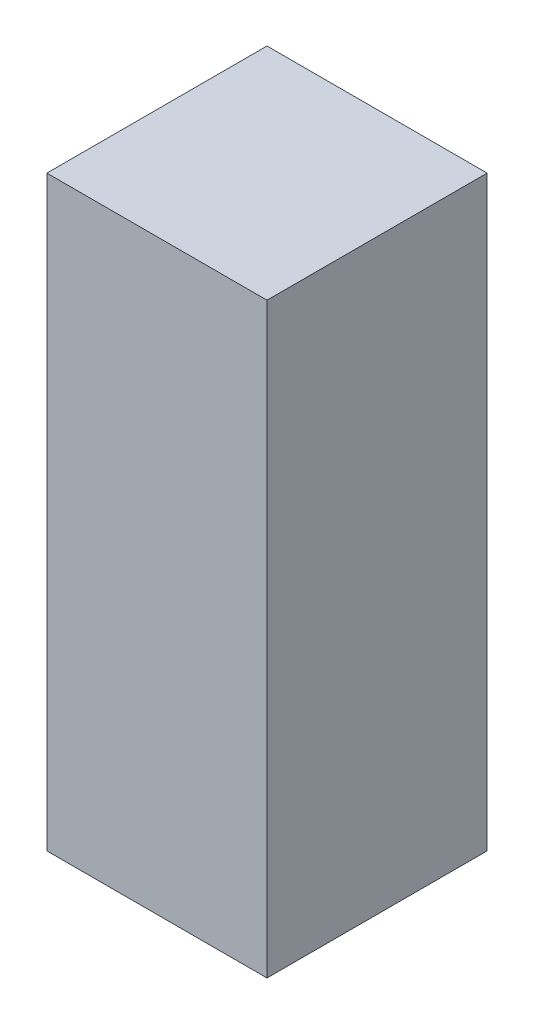
ISO-10303-21;
HEADER;
FILE_DESCRIPTION(('STEP AP214'),'2;1');
FILE_NAME('part.step','',(''),(''),'','','');
FILE_SCHEMA(('AUTOMOTIVE_DESIGN { 1 0 10303 214 1 1 1 1 }'));
ENDSEC;
DATA;
#1=APPLICATION_CONTEXT('core data for automotive mechanical design processes');
#2=APPLICATION_PROTOCOL_DEFINITION('international standard','automotive_design',2000,#1);
#3=PRODUCT_CONTEXT('',#1,'mechanical');
#4=PRODUCT('Part','Part','',(#3));
#5=PRODUCT_RELATED_PRODUCT_CATEGORY('part','',(#4));
#6=PRODUCT_DEFINITION_FORMATION('','',#4);
#7=PRODUCT_DEFINITION_CONTEXT('part definition',#1,'design');
#8=PRODUCT_DEFINITION('design','',#6,#7);
#9=PRODUCT_DEFINITION_SHAPE('','',#8);
#10=(LENGTH_UNIT() NAMED_UNIT(*) SI_UNIT(.MILLI.,.METRE.));
#11=(NAMED_UNIT(*) PLANE_ANGLE_UNIT() SI_UNIT($,.RADIAN.));
#12=(NAMED_UNIT(*) SI_UNIT($,.STERADIAN.) SOLID_ANGLE_UNIT());
#13=UNCERTAINTY_MEASURE_WITH_UNIT(LENGTH_MEASURE(1.E-05),#10,'distance_accuracy_value','');
#14=(GEOMETRIC_REPRESENTATION_CONTEXT(3) GLOBAL_UNCERTAINTY_ASSIGNED_CONTEXT((#13)) GLOBAL_UNIT_ASSIGNED_CONTEXT((#10,
#11,#12)) REPRESENTATION_CONTEXT('',''));
#15=CARTESIAN_POINT('',(0.,0.,0.));
#16=DIRECTION('',(0.,0.,1.));
#17=DIRECTION('',(1.,0.,0.));
#18=AXIS2_PLACEMENT_3D('',#15,#16,#17);
#19=CARTESIAN_POINT('',(0.,8.,0.));
#20=DIRECTION('',(1.,0.,0.));
#21=DIRECTION('',(0.,0.,-1.));
#22=AXIS2_PLACEMENT_3D('',#19,#20,#21);
#23=PLANE('',#22);
#24=DIRECTION('',(0.,0.,1.));
#25=VECTOR('',#24,1.);
#26=CARTESIAN_POINT('',(0.,0.,0.));
#27=LINE('',#26,#25);
#28=CARTESIAN_POINT('',(0.,0.,-3.));
#29=VERTEX_POINT('',#28);
#30=CARTESIAN_POINT('',(0.,0.,0.));
#31=VERTEX_POINT('',#30);
#32=EDGE_CURVE('E117',#29,#31,#27,.T.);
#33=ORIENTED_EDGE('',*,*,#32,.T.);
#34=DIRECTION('',(0.,-1.,0.));
#35=VECTOR('',#34,1.);
#36=CARTESIAN_POINT('',(0.,8.,0.));
#37=LINE('',#36,#35);
#38=CARTESIAN_POINT('',(0.,8.,0.));
#39=VERTEX_POINT('',#38);
#40=EDGE_CURVE('E11',#39,#31,#37,.T.);
#41=ORIENTED_EDGE('',*,*,#40,.F.);
#42=DIRECTION('',(0.,0.,1.));
#43=VECTOR('',#42,1.);
#44=CARTESIAN_POINT('',(0.,8.,0.));
#45=LINE('',#44,#43);
#46=CARTESIAN_POINT('',(0.,8.,-3.));
#47=VERTEX_POINT('',#46);
#48=EDGE_CURVE('E101',#47,#39,#45,.T.);
#49=ORIENTED_EDGE('',*,*,#48,.F.);
#50=DIRECTION('',(0.,-1.,0.));
#51=VECTOR('',#50,1.);
#52=CARTESIAN_POINT('',(0.,8.,-3.));
#53=LINE('',#52,#51);
#54=EDGE_CURVE('E113',#47,#29,#53,.T.);
#55=ORIENTED_EDGE('',*,*,#54,.T.);
#56=EDGE_LOOP('',(#33,#41,#49,#55));
#57=FACE_BOUND('',#56,.T.);
#58=ADVANCED_FACE('F49',(#57),#23,.F.);
#59=CARTESIAN_POINT('',(0.,8.,0.));
#60=DIRECTION('',(0.,0.,-1.));
#61=DIRECTION('',(-1.,0.,0.));
#62=AXIS2_PLACEMENT_3D('',#59,#60,#61);
#63=PLANE('',#62);
#64=DIRECTION('',(1.,0.,0.));
#65=VECTOR('',#64,1.);
#66=CARTESIAN_POINT('',(0.,0.,0.));
#67=LINE('',#66,#65);
#68=CARTESIAN_POINT('',(3.,0.,0.));
#69=VERTEX_POINT('',#68);
#70=EDGE_CURVE('E106',#31,#69,#67,.T.);
#71=ORIENTED_EDGE('',*,*,#70,.T.);
#72=DIRECTION('',(0.,-1.,0.));
#73=VECTOR('',#72,1.);
#74=CARTESIAN_POINT('',(3.,8.,0.));
#75=LINE('',#74,#73);
#76=CARTESIAN_POINT('',(3.,8.,0.));
#77=VERTEX_POINT('',#76);
#78=EDGE_CURVE('E58',#77,#69,#75,.T.);
#79=ORIENTED_EDGE('',*,*,#78,.F.);
#80=DIRECTION('',(1.,0.,0.));
#81=VECTOR('',#80,1.);
#82=CARTESIAN_POINT('',(0.,8.,0.));
#83=LINE('',#82,#81);
#84=EDGE_CURVE('E96',#39,#77,#83,.T.);
#85=ORIENTED_EDGE('',*,*,#84,.F.);
#86=ORIENTED_EDGE('',*,*,#40,.T.);
#87=EDGE_LOOP('',(#71,#79,#85,#86));
#88=FACE_BOUND('',#87,.T.);
#89=ADVANCED_FACE('F105',(#88),#63,.F.);
#90=CARTESIAN_POINT('',(3.,8.,0.));
#91=DIRECTION('',(-1.,0.,0.));
#92=DIRECTION('',(0.,0.,1.));
#93=AXIS2_PLACEMENT_3D('',#90,#91,#92);
#94=PLANE('',#93);
#95=DIRECTION('',(0.,0.,-1.));
#96=VECTOR('',#95,1.);
#97=CARTESIAN_POINT('',(3.,0.,0.));
#98=LINE('',#97,#96);
#99=CARTESIAN_POINT('',(3.,0.,-3.));
#100=VERTEX_POINT('',#99);
#101=EDGE_CURVE('E83',#69,#100,#98,.T.);
#102=ORIENTED_EDGE('',*,*,#101,.T.);
#103=DIRECTION('',(0.,-1.,0.));
#104=VECTOR('',#103,1.);
#105=CARTESIAN_POINT('',(3.,8.,-3.));
#106=LINE('',#105,#104);
#107=CARTESIAN_POINT('',(3.,8.,-3.));
#108=VERTEX_POINT('',#107);
#109=EDGE_CURVE('E108',#108,#100,#106,.T.);
#110=ORIENTED_EDGE('',*,*,#109,.F.);
#111=DIRECTION('',(0.,0.,-1.));
#112=VECTOR('',#111,1.);
#113=CARTESIAN_POINT('',(3.,8.,0.));
#114=LINE('',#113,#112);
#115=EDGE_CURVE('E99',#77,#108,#114,.T.);
#116=ORIENTED_EDGE('',*,*,#115,.F.);
#117=ORIENTED_EDGE('',*,*,#78,.T.);
#118=EDGE_LOOP('',(#102,#110,#116,#117));
#119=FACE_BOUND('',#118,.T.);
#120=ADVANCED_FACE('F109',(#119),#94,.F.);
#121=CARTESIAN_POINT('',(0.,8.,-3.));
#122=DIRECTION('',(0.,0.,1.));
#123=DIRECTION('',(1.,0.,0.));
#124=AXIS2_PLACEMENT_3D('',#121,#122,#123);
#125=PLANE('',#124);
#126=DIRECTION('',(-1.,0.,0.));
#127=VECTOR('',#126,1.);
#128=CARTESIAN_POINT('',(0.,0.,-3.));
#129=LINE('',#128,#127);
#130=EDGE_CURVE('E89',#100,#29,#129,.T.);
#131=ORIENTED_EDGE('',*,*,#130,.T.);
#132=ORIENTED_EDGE('',*,*,#54,.F.);
#133=DIRECTION('',(-1.,0.,0.));
#134=VECTOR('',#133,1.);
#135=CARTESIAN_POINT('',(0.,8.,-3.));
#136=LINE('',#135,#134);
#137=EDGE_CURVE('E66',#108,#47,#136,.T.);
#138=ORIENTED_EDGE('',*,*,#137,.F.);
#139=ORIENTED_EDGE('',*,*,#109,.T.);
#140=EDGE_LOOP('',(#131,#132,#138,#139));
#141=FACE_BOUND('',#140,.T.);
#142=ADVANCED_FACE('F130',(#141),#125,.F.);
#143=CARTESIAN_POINT('',(0.,8.,0.));
#144=DIRECTION('',(0.,-1.,0.));
#145=DIRECTION('',(0.,0.,-1.));
#146=AXIS2_PLACEMENT_3D('',#143,#144,#145);
#147=PLANE('',#146);
#148=ORIENTED_EDGE('',*,*,#48,.T.);
#149=ORIENTED_EDGE('',*,*,#84,.T.);
#150=ORIENTED_EDGE('',*,*,#115,.T.);
#151=ORIENTED_EDGE('',*,*,#137,.T.);
#152=EDGE_LOOP('',(#148,#149,#150,#151));
#153=FACE_BOUND('',#152,.T.);
#154=ADVANCED_FACE('F97',(#153),#147,.F.);
#155=CARTESIAN_POINT('',(0.,0.,0.));
#156=DIRECTION('',(0.,-1.,0.));
#157=DIRECTION('',(0.,0.,-1.));
#158=AXIS2_PLACEMENT_3D('',#155,#156,#157);
#159=PLANE('',#158);
#160=ORIENTED_EDGE('',*,*,#32,.F.);
#161=ORIENTED_EDGE('',*,*,#130,.F.);
#162=ORIENTED_EDGE('',*,*,#101,.F.);
#163=ORIENTED_EDGE('',*,*,#70,.F.);
#164=EDGE_LOOP('',(#160,#161,#162,#163));
#165=FACE_BOUND('',#164,.T.);
#166=ADVANCED_FACE('F133',(#165),#159,.T.);
#167=CLOSED_SHELL('',(#58,#89,#120,#142,#154,#166));
#168=MANIFOLD_SOLID_BREP('B2',#167);
#169=ADVANCED_BREP_SHAPE_REPRESENTATION('',(#18,#168),#14);
#170=SHAPE_DEFINITION_REPRESENTATION(#9,#169);
ENDSEC;
END-ISO-10303-21;
